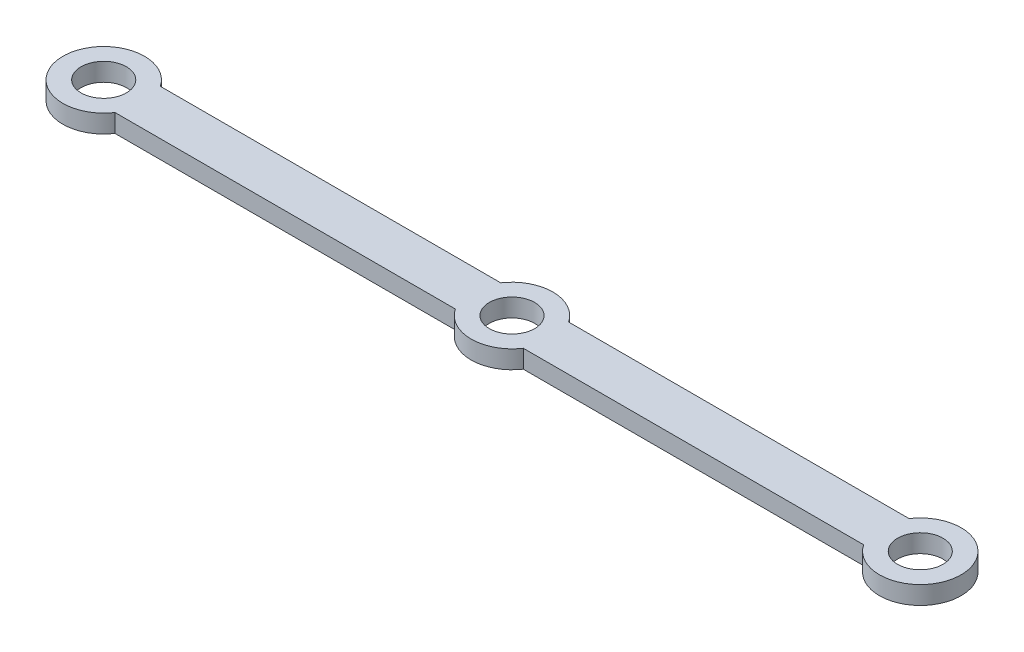
ISO-10303-21;
HEADER;
FILE_DESCRIPTION(('STEP AP214'),'2;1');
FILE_NAME('part.step','',(''),(''),'','','');
FILE_SCHEMA(('AUTOMOTIVE_DESIGN { 1 0 10303 214 1 1 1 1 }'));
ENDSEC;
DATA;
#1=APPLICATION_CONTEXT('core data for automotive mechanical design processes');
#2=APPLICATION_PROTOCOL_DEFINITION('international standard','automotive_design',2000,#1);
#3=PRODUCT_CONTEXT('',#1,'mechanical');
#4=PRODUCT('Part','Part','',(#3));
#5=PRODUCT_RELATED_PRODUCT_CATEGORY('part','',(#4));
#6=PRODUCT_DEFINITION_FORMATION('','',#4);
#7=PRODUCT_DEFINITION_CONTEXT('part definition',#1,'design');
#8=PRODUCT_DEFINITION('design','',#6,#7);
#9=PRODUCT_DEFINITION_SHAPE('','',#8);
#10=(LENGTH_UNIT() NAMED_UNIT(*) SI_UNIT(.MILLI.,.METRE.));
#11=(NAMED_UNIT(*) PLANE_ANGLE_UNIT() SI_UNIT($,.RADIAN.));
#12=(NAMED_UNIT(*) SI_UNIT($,.STERADIAN.) SOLID_ANGLE_UNIT());
#13=UNCERTAINTY_MEASURE_WITH_UNIT(LENGTH_MEASURE(1.E-05),#10,'distance_accuracy_value','');
#14=(GEOMETRIC_REPRESENTATION_CONTEXT(3) GLOBAL_UNCERTAINTY_ASSIGNED_CONTEXT((#13)) GLOBAL_UNIT_ASSIGNED_CONTEXT((#10,
#11,#12)) REPRESENTATION_CONTEXT('',''));
#15=CARTESIAN_POINT('',(0.,0.,0.));
#16=DIRECTION('',(0.,0.,1.));
#17=DIRECTION('',(1.,0.,0.));
#18=AXIS2_PLACEMENT_3D('',#15,#16,#17);
#19=CARTESIAN_POINT('',(90.,2.,0.));
#20=DIRECTION('',(0.,-1.,0.));
#21=DIRECTION('',(0.,0.,-1.));
#22=AXIS2_PLACEMENT_3D('',#19,#20,#21);
#23=CYLINDRICAL_SURFACE('',#22,4.5);
#24=CARTESIAN_POINT('',(90.,0.,0.));
#25=DIRECTION('',(0.,1.,0.));
#26=DIRECTION('',(0.,0.,1.));
#27=AXIS2_PLACEMENT_3D('',#24,#25,#26);
#28=CIRCLE('',#27,4.5);
#29=CARTESIAN_POINT('',(86.258342613226,0.,2.49999999999997));
#30=VERTEX_POINT('',#29);
#31=CARTESIAN_POINT('',(86.2583426132261,0.,-2.50000000000003));
#32=VERTEX_POINT('',#31);
#33=EDGE_CURVE('E140',#30,#32,#28,.T.);
#34=ORIENTED_EDGE('',*,*,#33,.T.);
#35=DIRECTION('',(0.,-1.,0.));
#36=VECTOR('',#35,1.);
#37=CARTESIAN_POINT('',(86.2583426132261,2.,-2.50000000000003));
#38=LINE('',#37,#36);
#39=CARTESIAN_POINT('',(86.2583426132261,2.,-2.50000000000003));
#40=VERTEX_POINT('',#39);
#41=EDGE_CURVE('E11',#40,#32,#38,.T.);
#42=ORIENTED_EDGE('',*,*,#41,.F.);
#43=CARTESIAN_POINT('',(90.,2.,0.));
#44=DIRECTION('',(0.,1.,0.));
#45=DIRECTION('',(0.,0.,1.));
#46=AXIS2_PLACEMENT_3D('',#43,#44,#45);
#47=CIRCLE('',#46,4.5);
#48=CARTESIAN_POINT('',(86.258342613226,2.,2.49999999999997));
#49=VERTEX_POINT('',#48);
#50=EDGE_CURVE('E90',#49,#40,#47,.T.);
#51=ORIENTED_EDGE('',*,*,#50,.F.);
#52=DIRECTION('',(0.,-1.,0.));
#53=VECTOR('',#52,1.);
#54=CARTESIAN_POINT('',(86.258342613226,2.,2.49999999999997));
#55=LINE('',#54,#53);
#56=EDGE_CURVE('E139',#49,#30,#55,.T.);
#57=ORIENTED_EDGE('',*,*,#56,.T.);
#58=EDGE_LOOP('',(#34,#42,#51,#57));
#59=FACE_BOUND('',#58,.T.);
#60=ADVANCED_FACE('F34',(#59),#23,.T.);
#61=CARTESIAN_POINT('',(0.,2.,-2.50000000000001));
#62=DIRECTION('',(0.,0.,-1.));
#63=DIRECTION('',(-1.,0.,0.));
#64=AXIS2_PLACEMENT_3D('',#61,#62,#63);
#65=PLANE('',#64);
#66=DIRECTION('',(1.,0.,0.));
#67=VECTOR('',#66,1.);
#68=CARTESIAN_POINT('',(0.,0.,-2.50000000000001));
#69=LINE('',#68,#67);
#70=CARTESIAN_POINT('',(48.7416573867739,0.,-2.50000000000002));
#71=VERTEX_POINT('',#70);
#72=EDGE_CURVE('E143',#71,#32,#69,.T.);
#73=ORIENTED_EDGE('',*,*,#72,.F.);
#74=DIRECTION('',(0.,-1.,0.));
#75=VECTOR('',#74,1.);
#76=CARTESIAN_POINT('',(48.7416573867739,2.,-2.50000000000002));
#77=LINE('',#76,#75);
#78=CARTESIAN_POINT('',(48.7416573867739,2.,-2.50000000000002));
#79=VERTEX_POINT('',#78);
#80=EDGE_CURVE('E42',#79,#71,#77,.T.);
#81=ORIENTED_EDGE('',*,*,#80,.F.);
#82=DIRECTION('',(1.,0.,0.));
#83=VECTOR('',#82,1.);
#84=CARTESIAN_POINT('',(0.,2.,-2.50000000000001));
#85=LINE('',#84,#83);
#86=EDGE_CURVE('E188',#79,#40,#85,.T.);
#87=ORIENTED_EDGE('',*,*,#86,.T.);
#88=ORIENTED_EDGE('',*,*,#41,.T.);
#89=EDGE_LOOP('',(#73,#81,#87,#88));
#90=FACE_BOUND('',#89,.T.);
#91=ADVANCED_FACE('F187',(#90),#65,.T.);
#92=CARTESIAN_POINT('',(45.,2.,0.));
#93=DIRECTION('',(0.,-1.,0.));
#94=DIRECTION('',(0.,0.,-1.));
#95=AXIS2_PLACEMENT_3D('',#92,#93,#94);
#96=CYLINDRICAL_SURFACE('',#95,4.5);
#97=CARTESIAN_POINT('',(45.,0.,0.));
#98=DIRECTION('',(0.,1.,0.));
#99=DIRECTION('',(0.,0.,1.));
#100=AXIS2_PLACEMENT_3D('',#97,#98,#99);
#101=CIRCLE('',#100,4.5);
#102=CARTESIAN_POINT('',(41.2583426132261,0.,-2.50000000000002));
#103=VERTEX_POINT('',#102);
#104=EDGE_CURVE('E146',#71,#103,#101,.T.);
#105=ORIENTED_EDGE('',*,*,#104,.T.);
#106=DIRECTION('',(0.,-1.,0.));
#107=VECTOR('',#106,1.);
#108=CARTESIAN_POINT('',(41.2583426132261,2.,-2.50000000000002));
#109=LINE('',#108,#107);
#110=CARTESIAN_POINT('',(41.2583426132261,2.,-2.50000000000002));
#111=VERTEX_POINT('',#110);
#112=EDGE_CURVE('E171',#111,#103,#109,.T.);
#113=ORIENTED_EDGE('',*,*,#112,.F.);
#114=CARTESIAN_POINT('',(45.,2.,0.));
#115=DIRECTION('',(0.,1.,0.));
#116=DIRECTION('',(0.,0.,1.));
#117=AXIS2_PLACEMENT_3D('',#114,#115,#116);
#118=CIRCLE('',#117,4.5);
#119=EDGE_CURVE('E177',#79,#111,#118,.T.);
#120=ORIENTED_EDGE('',*,*,#119,.F.);
#121=ORIENTED_EDGE('',*,*,#80,.T.);
#122=EDGE_LOOP('',(#105,#113,#120,#121));
#123=FACE_BOUND('',#122,.T.);
#124=ADVANCED_FACE('F175',(#123),#96,.T.);
#125=CARTESIAN_POINT('',(0.,2.,-2.50000000000001));
#126=DIRECTION('',(0.,0.,-1.));
#127=DIRECTION('',(-1.,0.,0.));
#128=AXIS2_PLACEMENT_3D('',#125,#126,#127);
#129=PLANE('',#128);
#130=DIRECTION('',(1.,0.,0.));
#131=VECTOR('',#130,1.);
#132=CARTESIAN_POINT('',(0.,0.,-2.50000000000001));
#133=LINE('',#132,#131);
#134=CARTESIAN_POINT('',(3.74165738677393,0.,-2.50000000000001));
#135=VERTEX_POINT('',#134);
#136=EDGE_CURVE('E149',#135,#103,#133,.T.);
#137=ORIENTED_EDGE('',*,*,#136,.F.);
#138=DIRECTION('',(0.,-1.,0.));
#139=VECTOR('',#138,1.);
#140=CARTESIAN_POINT('',(3.74165738677393,2.,-2.50000000000001));
#141=LINE('',#140,#139);
#142=CARTESIAN_POINT('',(3.74165738677393,2.,-2.50000000000001));
#143=VERTEX_POINT('',#142);
#144=EDGE_CURVE('E169',#143,#135,#141,.T.);
#145=ORIENTED_EDGE('',*,*,#144,.F.);
#146=DIRECTION('',(1.,0.,0.));
#147=VECTOR('',#146,1.);
#148=CARTESIAN_POINT('',(0.,2.,-2.50000000000001));
#149=LINE('',#148,#147);
#150=EDGE_CURVE('E194',#143,#111,#149,.T.);
#151=ORIENTED_EDGE('',*,*,#150,.T.);
#152=ORIENTED_EDGE('',*,*,#112,.T.);
#153=EDGE_LOOP('',(#137,#145,#151,#152));
#154=FACE_BOUND('',#153,.T.);
#155=ADVANCED_FACE('F192',(#154),#129,.T.);
#156=CARTESIAN_POINT('',(0.,2.,0.));
#157=DIRECTION('',(0.,-1.,0.));
#158=DIRECTION('',(0.,0.,-1.));
#159=AXIS2_PLACEMENT_3D('',#156,#157,#158);
#160=CYLINDRICAL_SURFACE('',#159,4.5);
#161=CARTESIAN_POINT('',(0.,0.,0.));
#162=DIRECTION('',(0.,1.,0.));
#163=DIRECTION('',(0.,0.,1.));
#164=AXIS2_PLACEMENT_3D('',#161,#162,#163);
#165=CIRCLE('',#164,4.5);
#166=CARTESIAN_POINT('',(3.74165738677395,0.,2.49999999999999));
#167=VERTEX_POINT('',#166);
#168=EDGE_CURVE('E152',#135,#167,#165,.T.);
#169=ORIENTED_EDGE('',*,*,#168,.T.);
#170=DIRECTION('',(0.,-1.,0.));
#171=VECTOR('',#170,1.);
#172=CARTESIAN_POINT('',(3.74165738677395,2.,2.49999999999999));
#173=LINE('',#172,#171);
#174=CARTESIAN_POINT('',(3.74165738677395,2.,2.49999999999999));
#175=VERTEX_POINT('',#174);
#176=EDGE_CURVE('E122',#175,#167,#173,.T.);
#177=ORIENTED_EDGE('',*,*,#176,.F.);
#178=CARTESIAN_POINT('',(0.,2.,0.));
#179=DIRECTION('',(0.,1.,0.));
#180=DIRECTION('',(0.,0.,1.));
#181=AXIS2_PLACEMENT_3D('',#178,#179,#180);
#182=CIRCLE('',#181,4.5);
#183=EDGE_CURVE('E113',#143,#175,#182,.T.);
#184=ORIENTED_EDGE('',*,*,#183,.F.);
#185=ORIENTED_EDGE('',*,*,#144,.T.);
#186=EDGE_LOOP('',(#169,#177,#184,#185));
#187=FACE_BOUND('',#186,.T.);
#188=ADVANCED_FACE('F199',(#187),#160,.T.);
#189=CARTESIAN_POINT('',(0.,2.,2.49999999999999));
#190=DIRECTION('',(0.,0.,-1.));
#191=DIRECTION('',(-1.,0.,0.));
#192=AXIS2_PLACEMENT_3D('',#189,#190,#191);
#193=PLANE('',#192);
#194=DIRECTION('',(1.,0.,0.));
#195=VECTOR('',#194,1.);
#196=CARTESIAN_POINT('',(0.,0.,2.49999999999999));
#197=LINE('',#196,#195);
#198=CARTESIAN_POINT('',(41.258342613226,0.,2.49999999999998));
#199=VERTEX_POINT('',#198);
#200=EDGE_CURVE('E121',#167,#199,#197,.T.);
#201=ORIENTED_EDGE('',*,*,#200,.T.);
#202=DIRECTION('',(0.,-1.,0.));
#203=VECTOR('',#202,1.);
#204=CARTESIAN_POINT('',(41.258342613226,2.,2.49999999999998));
#205=LINE('',#204,#203);
#206=CARTESIAN_POINT('',(41.258342613226,2.,2.49999999999998));
#207=VERTEX_POINT('',#206);
#208=EDGE_CURVE('E118',#207,#199,#205,.T.);
#209=ORIENTED_EDGE('',*,*,#208,.F.);
#210=DIRECTION('',(1.,0.,0.));
#211=VECTOR('',#210,1.);
#212=CARTESIAN_POINT('',(0.,2.,2.49999999999999));
#213=LINE('',#212,#211);
#214=EDGE_CURVE('E105',#175,#207,#213,.T.);
#215=ORIENTED_EDGE('',*,*,#214,.F.);
#216=ORIENTED_EDGE('',*,*,#176,.T.);
#217=EDGE_LOOP('',(#201,#209,#215,#216));
#218=FACE_BOUND('',#217,.T.);
#219=ADVANCED_FACE('F119',(#218),#193,.F.);
#220=CARTESIAN_POINT('',(45.,2.,0.));
#221=DIRECTION('',(0.,-1.,0.));
#222=DIRECTION('',(0.,0.,-1.));
#223=AXIS2_PLACEMENT_3D('',#220,#221,#222);
#224=CYLINDRICAL_SURFACE('',#223,4.5);
#225=CARTESIAN_POINT('',(45.,0.,0.));
#226=DIRECTION('',(0.,1.,0.));
#227=DIRECTION('',(0.,0.,1.));
#228=AXIS2_PLACEMENT_3D('',#225,#226,#227);
#229=CIRCLE('',#228,4.5);
#230=CARTESIAN_POINT('',(48.741657386774,0.,2.49999999999998));
#231=VERTEX_POINT('',#230);
#232=EDGE_CURVE('E78',#199,#231,#229,.T.);
#233=ORIENTED_EDGE('',*,*,#232,.T.);
#234=DIRECTION('',(0.,-1.,0.));
#235=VECTOR('',#234,1.);
#236=CARTESIAN_POINT('',(48.741657386774,2.,2.49999999999998));
#237=LINE('',#236,#235);
#238=CARTESIAN_POINT('',(48.741657386774,2.,2.49999999999998));
#239=VERTEX_POINT('',#238);
#240=EDGE_CURVE('E123',#239,#231,#237,.T.);
#241=ORIENTED_EDGE('',*,*,#240,.F.);
#242=CARTESIAN_POINT('',(45.,2.,0.));
#243=DIRECTION('',(0.,1.,0.));
#244=DIRECTION('',(0.,0.,1.));
#245=AXIS2_PLACEMENT_3D('',#242,#243,#244);
#246=CIRCLE('',#245,4.5);
#247=EDGE_CURVE('E110',#207,#239,#246,.T.);
#248=ORIENTED_EDGE('',*,*,#247,.F.);
#249=ORIENTED_EDGE('',*,*,#208,.T.);
#250=EDGE_LOOP('',(#233,#241,#248,#249));
#251=FACE_BOUND('',#250,.T.);
#252=ADVANCED_FACE('F125',(#251),#224,.T.);
#253=CARTESIAN_POINT('',(0.,2.,0.));
#254=DIRECTION('',(0.,-1.,0.));
#255=DIRECTION('',(0.,0.,-1.));
#256=AXIS2_PLACEMENT_3D('',#253,#254,#255);
#257=CYLINDRICAL_SURFACE('',#256,2.5);
#258=CARTESIAN_POINT('',(0.,2.,0.));
#259=DIRECTION('',(0.,1.,0.));
#260=DIRECTION('',(0.,0.,1.));
#261=AXIS2_PLACEMENT_3D('',#258,#259,#260);
#262=CIRCLE('',#261,2.5);
#263=CARTESIAN_POINT('',(0.,2.,2.5));
#264=VERTEX_POINT('',#263);
#265=EDGE_CURVE('E133',#264,#264,#262,.T.);
#266=ORIENTED_EDGE('',*,*,#265,.T.);
#267=EDGE_LOOP('',(#266));
#268=FACE_BOUND('',#267,.T.);
#269=CARTESIAN_POINT('',(0.,0.,0.));
#270=DIRECTION('',(0.,1.,0.));
#271=DIRECTION('',(0.,0.,1.));
#272=AXIS2_PLACEMENT_3D('',#269,#270,#271);
#273=CIRCLE('',#272,2.5);
#274=CARTESIAN_POINT('',(0.,0.,2.5));
#275=VERTEX_POINT('',#274);
#276=EDGE_CURVE('E160',#275,#275,#273,.T.);
#277=ORIENTED_EDGE('',*,*,#276,.F.);
#278=EDGE_LOOP('',(#277));
#279=FACE_BOUND('',#278,.T.);
#280=ADVANCED_FACE('F241',(#268,#279),#257,.F.);
#281=CARTESIAN_POINT('',(45.,2.,0.));
#282=DIRECTION('',(0.,-1.,0.));
#283=DIRECTION('',(0.,0.,-1.));
#284=AXIS2_PLACEMENT_3D('',#281,#282,#283);
#285=CYLINDRICAL_SURFACE('',#284,2.49999999999999);
#286=CARTESIAN_POINT('',(45.,2.,0.));
#287=DIRECTION('',(0.,1.,0.));
#288=DIRECTION('',(0.,0.,1.));
#289=AXIS2_PLACEMENT_3D('',#286,#287,#288);
#290=CIRCLE('',#289,2.49999999999999);
#291=CARTESIAN_POINT('',(45.,2.,2.49999999999999));
#292=VERTEX_POINT('',#291);
#293=EDGE_CURVE('E127',#292,#292,#290,.T.);
#294=ORIENTED_EDGE('',*,*,#293,.T.);
#295=EDGE_LOOP('',(#294));
#296=FACE_BOUND('',#295,.T.);
#297=CARTESIAN_POINT('',(45.,0.,0.));
#298=DIRECTION('',(0.,1.,0.));
#299=DIRECTION('',(0.,0.,1.));
#300=AXIS2_PLACEMENT_3D('',#297,#298,#299);
#301=CIRCLE('',#300,2.49999999999999);
#302=CARTESIAN_POINT('',(45.,0.,2.49999999999999));
#303=VERTEX_POINT('',#302);
#304=EDGE_CURVE('E157',#303,#303,#301,.T.);
#305=ORIENTED_EDGE('',*,*,#304,.F.);
#306=EDGE_LOOP('',(#305));
#307=FACE_BOUND('',#306,.T.);
#308=ADVANCED_FACE('F250',(#296,#307),#285,.F.);
#309=CARTESIAN_POINT('',(0.,2.,2.49999999999999));
#310=DIRECTION('',(0.,0.,-1.));
#311=DIRECTION('',(-1.,0.,0.));
#312=AXIS2_PLACEMENT_3D('',#309,#310,#311);
#313=PLANE('',#312);
#314=DIRECTION('',(1.,0.,0.));
#315=VECTOR('',#314,1.);
#316=CARTESIAN_POINT('',(0.,0.,2.49999999999999));
#317=LINE('',#316,#315);
#318=EDGE_CURVE('E84',#231,#30,#317,.T.);
#319=ORIENTED_EDGE('',*,*,#318,.T.);
#320=ORIENTED_EDGE('',*,*,#56,.F.);
#321=DIRECTION('',(1.,0.,0.));
#322=VECTOR('',#321,1.);
#323=CARTESIAN_POINT('',(0.,2.,2.49999999999999));
#324=LINE('',#323,#322);
#325=EDGE_CURVE('E50',#239,#49,#324,.T.);
#326=ORIENTED_EDGE('',*,*,#325,.F.);
#327=ORIENTED_EDGE('',*,*,#240,.T.);
#328=EDGE_LOOP('',(#319,#320,#326,#327));
#329=FACE_BOUND('',#328,.T.);
#330=ADVANCED_FACE('F260',(#329),#313,.F.);
#331=CARTESIAN_POINT('',(90.,2.,0.));
#332=DIRECTION('',(0.,-1.,0.));
#333=DIRECTION('',(0.,0.,-1.));
#334=AXIS2_PLACEMENT_3D('',#331,#332,#333);
#335=CYLINDRICAL_SURFACE('',#334,2.49999999999999);
#336=CARTESIAN_POINT('',(90.,2.,0.));
#337=DIRECTION('',(0.,1.,0.));
#338=DIRECTION('',(0.,0.,1.));
#339=AXIS2_PLACEMENT_3D('',#336,#337,#338);
#340=CIRCLE('',#339,2.49999999999999);
#341=CARTESIAN_POINT('',(90.,2.,2.49999999999998));
#342=VERTEX_POINT('',#341);
#343=EDGE_CURVE('E136',#342,#342,#340,.T.);
#344=ORIENTED_EDGE('',*,*,#343,.T.);
#345=EDGE_LOOP('',(#344));
#346=FACE_BOUND('',#345,.T.);
#347=CARTESIAN_POINT('',(90.,0.,0.));
#348=DIRECTION('',(0.,1.,0.));
#349=DIRECTION('',(0.,0.,1.));
#350=AXIS2_PLACEMENT_3D('',#347,#348,#349);
#351=CIRCLE('',#350,2.49999999999999);
#352=CARTESIAN_POINT('',(90.,0.,2.49999999999998));
#353=VERTEX_POINT('',#352);
#354=EDGE_CURVE('E163',#353,#353,#351,.T.);
#355=ORIENTED_EDGE('',*,*,#354,.F.);
#356=EDGE_LOOP('',(#355));
#357=FACE_BOUND('',#356,.T.);
#358=ADVANCED_FACE('F270',(#346,#357),#335,.F.);
#359=CARTESIAN_POINT('',(0.,2.,0.));
#360=DIRECTION('',(0.,1.,0.));
#361=DIRECTION('',(0.,0.,1.));
#362=AXIS2_PLACEMENT_3D('',#359,#360,#361);
#363=PLANE('',#362);
#364=ORIENTED_EDGE('',*,*,#50,.T.);
#365=ORIENTED_EDGE('',*,*,#86,.F.);
#366=ORIENTED_EDGE('',*,*,#119,.T.);
#367=ORIENTED_EDGE('',*,*,#150,.F.);
#368=ORIENTED_EDGE('',*,*,#183,.T.);
#369=ORIENTED_EDGE('',*,*,#214,.T.);
#370=ORIENTED_EDGE('',*,*,#247,.T.);
#371=ORIENTED_EDGE('',*,*,#325,.T.);
#372=EDGE_LOOP('',(#364,#365,#366,#367,#368,#369,#370,#371));
#373=FACE_BOUND('',#372,.T.);
#374=ORIENTED_EDGE('',*,*,#293,.F.);
#375=EDGE_LOOP('',(#374));
#376=FACE_BOUND('',#375,.T.);
#377=ORIENTED_EDGE('',*,*,#265,.F.);
#378=EDGE_LOOP('',(#377));
#379=FACE_BOUND('',#378,.T.);
#380=ORIENTED_EDGE('',*,*,#343,.F.);
#381=EDGE_LOOP('',(#380));
#382=FACE_BOUND('',#381,.T.);
#383=ADVANCED_FACE('F107',(#373,#376,#379,#382),#363,.T.);
#384=CARTESIAN_POINT('',(0.,0.,0.));
#385=DIRECTION('',(0.,1.,0.));
#386=DIRECTION('',(0.,0.,1.));
#387=AXIS2_PLACEMENT_3D('',#384,#385,#386);
#388=PLANE('',#387);
#389=ORIENTED_EDGE('',*,*,#33,.F.);
#390=ORIENTED_EDGE('',*,*,#318,.F.);
#391=ORIENTED_EDGE('',*,*,#232,.F.);
#392=ORIENTED_EDGE('',*,*,#200,.F.);
#393=ORIENTED_EDGE('',*,*,#168,.F.);
#394=ORIENTED_EDGE('',*,*,#136,.T.);
#395=ORIENTED_EDGE('',*,*,#104,.F.);
#396=ORIENTED_EDGE('',*,*,#72,.T.);
#397=EDGE_LOOP('',(#389,#390,#391,#392,#393,#394,#395,#396));
#398=FACE_BOUND('',#397,.T.);
#399=ORIENTED_EDGE('',*,*,#304,.T.);
#400=EDGE_LOOP('',(#399));
#401=FACE_BOUND('',#400,.T.);
#402=ORIENTED_EDGE('',*,*,#276,.T.);
#403=EDGE_LOOP('',(#402));
#404=FACE_BOUND('',#403,.T.);
#405=ORIENTED_EDGE('',*,*,#354,.T.);
#406=EDGE_LOOP('',(#405));
#407=FACE_BOUND('',#406,.T.);
#408=ADVANCED_FACE('F183',(#398,#401,#404,#407),#388,.F.);
#409=CLOSED_SHELL('',(#60,#91,#124,#155,#188,#219,#252,#280,#308,#330,#358,#383,#408));
#410=MANIFOLD_SOLID_BREP('B2',#409);
#411=ADVANCED_BREP_SHAPE_REPRESENTATION('',(#18,#410),#14);
#412=SHAPE_DEFINITION_REPRESENTATION(#9,#411);
ENDSEC;
END-ISO-10303-21;
